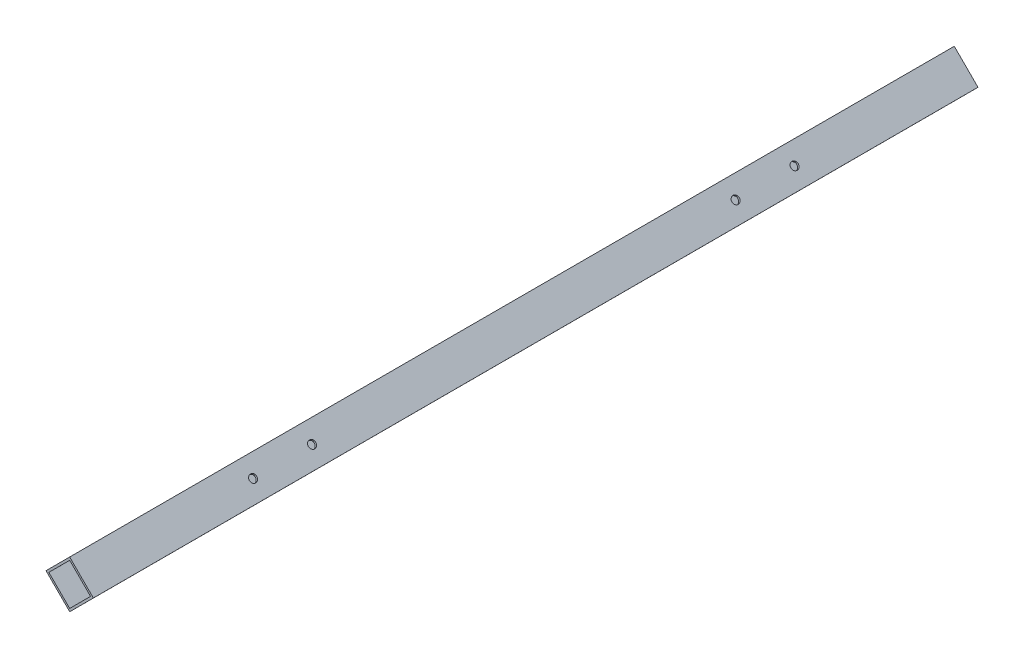
ISO-10303-21;
HEADER;
FILE_DESCRIPTION(('STEP AP214'),'2;1');
FILE_NAME('part.step','',(''),(''),'','','');
FILE_SCHEMA(('AUTOMOTIVE_DESIGN { 1 0 10303 214 1 1 1 1 }'));
ENDSEC;
DATA;
#1=APPLICATION_CONTEXT('core data for automotive mechanical design processes');
#2=APPLICATION_PROTOCOL_DEFINITION('international standard','automotive_design',2000,#1);
#3=PRODUCT_CONTEXT('',#1,'mechanical');
#4=PRODUCT('Part','Part','',(#3));
#5=PRODUCT_RELATED_PRODUCT_CATEGORY('part','',(#4));
#6=PRODUCT_DEFINITION_FORMATION('','',#4);
#7=PRODUCT_DEFINITION_CONTEXT('part definition',#1,'design');
#8=PRODUCT_DEFINITION('design','',#6,#7);
#9=PRODUCT_DEFINITION_SHAPE('','',#8);
#10=(LENGTH_UNIT() NAMED_UNIT(*) SI_UNIT(.MILLI.,.METRE.));
#11=(NAMED_UNIT(*) PLANE_ANGLE_UNIT() SI_UNIT($,.RADIAN.));
#12=(NAMED_UNIT(*) SI_UNIT($,.STERADIAN.) SOLID_ANGLE_UNIT());
#13=UNCERTAINTY_MEASURE_WITH_UNIT(LENGTH_MEASURE(1.E-05),#10,'distance_accuracy_value','');
#14=(GEOMETRIC_REPRESENTATION_CONTEXT(3) GLOBAL_UNCERTAINTY_ASSIGNED_CONTEXT((#13)) GLOBAL_UNIT_ASSIGNED_CONTEXT((#10,
#11,#12)) REPRESENTATION_CONTEXT('',''));
#15=CARTESIAN_POINT('',(0.,0.,0.));
#16=DIRECTION('',(0.,0.,1.));
#17=DIRECTION('',(1.,0.,0.));
#18=AXIS2_PLACEMENT_3D('',#15,#16,#17);
#19=CARTESIAN_POINT('',(0.,0.,660.));
#20=DIRECTION('',(0.,0.,1.));
#21=DIRECTION('',(1.,0.,0.));
#22=AXIS2_PLACEMENT_3D('',#19,#20,#21);
#23=PLANE('',#22);
#24=DIRECTION('',(-0.70646122875546,-0.707751744798503,0.));
#25=VECTOR('',#24,1.);
#26=CARTESIAN_POINT('',(0.,0.,660.));
#27=LINE('',#26,#25);
#28=CARTESIAN_POINT('',(0.,0.,660.));
#29=VERTEX_POINT('',#28);
#30=CARTESIAN_POINT('',(-17.6615307188865,-17.6937936199626,660.));
#31=VERTEX_POINT('',#30);
#32=EDGE_CURVE('E143',#29,#31,#27,.T.);
#33=ORIENTED_EDGE('',*,*,#32,.T.);
#34=DIRECTION('',(0.707751744798503,-0.70646122875546,0.));
#35=VECTOR('',#34,1.);
#36=CARTESIAN_POINT('',(-17.6615307188865,-17.6937936199626,660.));
#37=LINE('',#36,#35);
#38=CARTESIAN_POINT('',(0.0322629010760627,-35.3553243388491,660.));
#39=VERTEX_POINT('',#38);
#40=EDGE_CURVE('E146',#31,#39,#37,.T.);
#41=ORIENTED_EDGE('',*,*,#40,.T.);
#42=DIRECTION('',(0.70646122875546,0.707751744798503,0.));
#43=VECTOR('',#42,1.);
#44=CARTESIAN_POINT('',(17.6937936199626,-17.6615307188865,660.));
#45=LINE('',#44,#43);
#46=CARTESIAN_POINT('',(17.6937936199626,-17.6615307188865,660.));
#47=VERTEX_POINT('',#46);
#48=EDGE_CURVE('E149',#39,#47,#45,.T.);
#49=ORIENTED_EDGE('',*,*,#48,.T.);
#50=DIRECTION('',(-0.707751744798503,0.70646122875546,0.));
#51=VECTOR('',#50,1.);
#52=CARTESIAN_POINT('',(0.,0.,660.));
#53=LINE('',#52,#51);
#54=EDGE_CURVE('E151',#47,#29,#53,.T.);
#55=ORIENTED_EDGE('',*,*,#54,.T.);
#56=EDGE_LOOP('',(#33,#41,#49,#55));
#57=FACE_BOUND('',#56,.T.);
#58=DIRECTION('',(-0.706461228755461,-0.707751744798503,0.));
#59=VECTOR('',#58,1.);
#60=CARTESIAN_POINT('',(0.00193577406456353,-2.12131946033095,660.));
#61=LINE('',#60,#59);
#62=CARTESIAN_POINT('',(0.00193577406456353,-2.12131946033095,660.));
#63=VERTEX_POINT('',#62);
#64=CARTESIAN_POINT('',(-15.5402112585556,-17.691857845898,660.));
#65=VERTEX_POINT('',#64);
#66=EDGE_CURVE('E113',#63,#65,#61,.T.);
#67=ORIENTED_EDGE('',*,*,#66,.F.);
#68=DIRECTION('',(-0.707751744798503,0.70646122875546,0.));
#69=VECTOR('',#68,1.);
#70=CARTESIAN_POINT('',(0.00193577406456353,-2.12131946033095,660.));
#71=LINE('',#70,#69);
#72=CARTESIAN_POINT('',(15.5724741596316,-17.6634664929511,660.));
#73=VERTEX_POINT('',#72);
#74=EDGE_CURVE('E105',#73,#63,#71,.T.);
#75=ORIENTED_EDGE('',*,*,#74,.F.);
#76=DIRECTION('',(0.70646122875546,0.707751744798503,0.));
#77=VECTOR('',#76,1.);
#78=CARTESIAN_POINT('',(15.5724741596316,-17.6634664929511,660.));
#79=LINE('',#78,#77);
#80=CARTESIAN_POINT('',(0.0303271270114952,-33.2340048785181,660.));
#81=VERTEX_POINT('',#80);
#82=EDGE_CURVE('E127',#81,#73,#79,.T.);
#83=ORIENTED_EDGE('',*,*,#82,.F.);
#84=DIRECTION('',(0.707751744798503,-0.70646122875546,0.));
#85=VECTOR('',#84,1.);
#86=CARTESIAN_POINT('',(-15.5402112585556,-17.691857845898,660.));
#87=LINE('',#86,#85);
#88=EDGE_CURVE('E125',#65,#81,#87,.T.);
#89=ORIENTED_EDGE('',*,*,#88,.F.);
#90=EDGE_LOOP('',(#67,#75,#83,#89));
#91=FACE_BOUND('',#90,.T.);
#92=ADVANCED_FACE('F38',(#57,#91),#23,.T.);
#93=CARTESIAN_POINT('',(0.,0.,0.));
#94=DIRECTION('',(0.,0.,1.));
#95=DIRECTION('',(1.,0.,0.));
#96=AXIS2_PLACEMENT_3D('',#93,#94,#95);
#97=PLANE('',#96);
#98=DIRECTION('',(-0.70646122875546,-0.707751744798503,0.));
#99=VECTOR('',#98,1.);
#100=CARTESIAN_POINT('',(0.,0.,0.));
#101=LINE('',#100,#99);
#102=CARTESIAN_POINT('',(0.,0.,0.));
#103=VERTEX_POINT('',#102);
#104=CARTESIAN_POINT('',(-17.6615307188865,-17.6937936199626,0.));
#105=VERTEX_POINT('',#104);
#106=EDGE_CURVE('E121',#103,#105,#101,.T.);
#107=ORIENTED_EDGE('',*,*,#106,.F.);
#108=DIRECTION('',(-0.707751744798503,0.70646122875546,0.));
#109=VECTOR('',#108,1.);
#110=CARTESIAN_POINT('',(0.,0.,0.));
#111=LINE('',#110,#109);
#112=CARTESIAN_POINT('',(17.6937936199626,-17.6615307188865,0.));
#113=VERTEX_POINT('',#112);
#114=EDGE_CURVE('E147',#113,#103,#111,.T.);
#115=ORIENTED_EDGE('',*,*,#114,.F.);
#116=DIRECTION('',(0.70646122875546,0.707751744798503,0.));
#117=VECTOR('',#116,1.);
#118=CARTESIAN_POINT('',(17.6937936199626,-17.6615307188865,0.));
#119=LINE('',#118,#117);
#120=CARTESIAN_POINT('',(0.0322629010760627,-35.3553243388491,0.));
#121=VERTEX_POINT('',#120);
#122=EDGE_CURVE('E158',#121,#113,#119,.T.);
#123=ORIENTED_EDGE('',*,*,#122,.F.);
#124=DIRECTION('',(0.707751744798503,-0.70646122875546,0.));
#125=VECTOR('',#124,1.);
#126=CARTESIAN_POINT('',(-17.6615307188865,-17.6937936199626,0.));
#127=LINE('',#126,#125);
#128=EDGE_CURVE('E156',#105,#121,#127,.T.);
#129=ORIENTED_EDGE('',*,*,#128,.F.);
#130=EDGE_LOOP('',(#107,#115,#123,#129));
#131=FACE_BOUND('',#130,.T.);
#132=DIRECTION('',(-0.707751744798503,0.70646122875546,0.));
#133=VECTOR('',#132,1.);
#134=CARTESIAN_POINT('',(0.00193577406456353,-2.12131946033095,0.));
#135=LINE('',#134,#133);
#136=CARTESIAN_POINT('',(15.5724741596316,-17.6634664929511,0.));
#137=VERTEX_POINT('',#136);
#138=CARTESIAN_POINT('',(0.00193577406456353,-2.12131946033095,0.));
#139=VERTEX_POINT('',#138);
#140=EDGE_CURVE('E63',#137,#139,#135,.T.);
#141=ORIENTED_EDGE('',*,*,#140,.T.);
#142=DIRECTION('',(-0.706461228755461,-0.707751744798503,0.));
#143=VECTOR('',#142,1.);
#144=CARTESIAN_POINT('',(0.00193577406456353,-2.12131946033095,0.));
#145=LINE('',#144,#143);
#146=CARTESIAN_POINT('',(-15.5402112585556,-17.691857845898,0.));
#147=VERTEX_POINT('',#146);
#148=EDGE_CURVE('E120',#139,#147,#145,.T.);
#149=ORIENTED_EDGE('',*,*,#148,.T.);
#150=DIRECTION('',(0.707751744798503,-0.70646122875546,0.));
#151=VECTOR('',#150,1.);
#152=CARTESIAN_POINT('',(-15.5402112585556,-17.691857845898,0.));
#153=LINE('',#152,#151);
#154=CARTESIAN_POINT('',(0.0303271270114987,-33.2340048785181,0.));
#155=VERTEX_POINT('',#154);
#156=EDGE_CURVE('E135',#147,#155,#153,.T.);
#157=ORIENTED_EDGE('',*,*,#156,.T.);
#158=DIRECTION('',(0.70646122875546,0.707751744798503,0.));
#159=VECTOR('',#158,1.);
#160=CARTESIAN_POINT('',(15.5724741596316,-17.6634664929511,0.));
#161=LINE('',#160,#159);
#162=EDGE_CURVE('E114',#155,#137,#161,.T.);
#163=ORIENTED_EDGE('',*,*,#162,.T.);
#164=EDGE_LOOP('',(#141,#149,#157,#163));
#165=FACE_BOUND('',#164,.T.);
#166=ADVANCED_FACE('F227',(#131,#165),#97,.F.);
#167=CARTESIAN_POINT('',(0.,0.,660.));
#168=DIRECTION('',(0.707751744798503,-0.70646122875546,0.));
#169=DIRECTION('',(0.70646122875546,0.707751744798503,0.));
#170=AXIS2_PLACEMENT_3D('',#167,#168,#169);
#171=PLANE('',#170);
#172=ORIENTED_EDGE('',*,*,#106,.T.);
#173=DIRECTION('',(0.,0.,-1.));
#174=VECTOR('',#173,1.);
#175=CARTESIAN_POINT('',(-17.6615307188865,-17.6937936199626,660.));
#176=LINE('',#175,#174);
#177=EDGE_CURVE('E11',#31,#105,#176,.T.);
#178=ORIENTED_EDGE('',*,*,#177,.F.);
#179=ORIENTED_EDGE('',*,*,#32,.F.);
#180=DIRECTION('',(0.,0.,-1.));
#181=VECTOR('',#180,1.);
#182=CARTESIAN_POINT('',(0.,0.,660.));
#183=LINE('',#182,#181);
#184=EDGE_CURVE('E153',#29,#103,#183,.T.);
#185=ORIENTED_EDGE('',*,*,#184,.T.);
#186=EDGE_LOOP('',(#172,#178,#179,#185));
#187=FACE_BOUND('',#186,.T.);
#188=ADVANCED_FACE('F40',(#187),#171,.F.);
#189=CARTESIAN_POINT('',(-17.6615307188865,-17.6937936199626,660.));
#190=DIRECTION('',(0.70646122875546,0.707751744798503,0.));
#191=DIRECTION('',(-0.707751744798503,0.70646122875546,0.));
#192=AXIS2_PLACEMENT_3D('',#189,#190,#191);
#193=PLANE('',#192);
#194=CARTESIAN_POINT('',(-8.81463390890522,-26.5245589794058,532.));
#195=DIRECTION('',(0.70646122875546,0.707751744798503,0.));
#196=DIRECTION('',(-0.707751744798503,0.70646122875546,0.));
#197=AXIS2_PLACEMENT_3D('',#194,#195,#196);
#198=CIRCLE('',#197,2.74999999999996);
#199=CARTESIAN_POINT('',(-10.7609512071011,-24.5817906003283,532.));
#200=VERTEX_POINT('',#199);
#201=EDGE_CURVE('E133',#200,#200,#198,.T.);
#202=ORIENTED_EDGE('',*,*,#201,.T.);
#203=EDGE_LOOP('',(#202));
#204=FACE_BOUND('',#203,.T.);
#205=CARTESIAN_POINT('',(-8.81463390890523,-26.5245589794058,128.));
#206=DIRECTION('',(0.70646122875546,0.707751744798503,0.));
#207=DIRECTION('',(-0.707751744798503,0.70646122875546,0.));
#208=AXIS2_PLACEMENT_3D('',#205,#206,#207);
#209=CIRCLE('',#208,2.75);
#210=CARTESIAN_POINT('',(-10.7609512071011,-24.5817906003283,128.));
#211=VERTEX_POINT('',#210);
#212=EDGE_CURVE('E184',#211,#211,#209,.T.);
#213=ORIENTED_EDGE('',*,*,#212,.T.);
#214=EDGE_LOOP('',(#213));
#215=FACE_BOUND('',#214,.T.);
#216=CARTESIAN_POINT('',(-8.81463390890523,-26.5245589794058,172.));
#217=DIRECTION('',(0.70646122875546,0.707751744798503,0.));
#218=DIRECTION('',(-0.707751744798503,0.70646122875546,0.));
#219=AXIS2_PLACEMENT_3D('',#216,#217,#218);
#220=CIRCLE('',#219,2.75);
#221=CARTESIAN_POINT('',(-10.7609512071011,-24.5817906003283,172.));
#222=VERTEX_POINT('',#221);
#223=EDGE_CURVE('E180',#222,#222,#220,.T.);
#224=ORIENTED_EDGE('',*,*,#223,.T.);
#225=EDGE_LOOP('',(#224));
#226=FACE_BOUND('',#225,.T.);
#227=CARTESIAN_POINT('',(-8.81463390890523,-26.5245589794058,488.));
#228=DIRECTION('',(0.70646122875546,0.707751744798503,0.));
#229=DIRECTION('',(-0.707751744798503,0.70646122875546,0.));
#230=AXIS2_PLACEMENT_3D('',#227,#228,#229);
#231=CIRCLE('',#230,2.75);
#232=CARTESIAN_POINT('',(-10.7609512071011,-24.5817906003283,488.));
#233=VERTEX_POINT('',#232);
#234=EDGE_CURVE('E176',#233,#233,#231,.T.);
#235=ORIENTED_EDGE('',*,*,#234,.T.);
#236=EDGE_LOOP('',(#235));
#237=FACE_BOUND('',#236,.T.);
#238=ORIENTED_EDGE('',*,*,#128,.T.);
#239=DIRECTION('',(0.,0.,-1.));
#240=VECTOR('',#239,1.);
#241=CARTESIAN_POINT('',(0.0322629010760627,-35.3553243388491,660.));
#242=LINE('',#241,#240);
#243=EDGE_CURVE('E47',#39,#121,#242,.T.);
#244=ORIENTED_EDGE('',*,*,#243,.F.);
#245=ORIENTED_EDGE('',*,*,#40,.F.);
#246=ORIENTED_EDGE('',*,*,#177,.T.);
#247=EDGE_LOOP('',(#238,#244,#245,#246));
#248=FACE_BOUND('',#247,.T.);
#249=ADVANCED_FACE('F201',(#204,#215,#226,#237,#248),#193,.F.);
#250=CARTESIAN_POINT('',(17.6937936199626,-17.6615307188865,660.));
#251=DIRECTION('',(-0.707751744798503,0.70646122875546,0.));
#252=DIRECTION('',(-0.70646122875546,-0.707751744798503,0.));
#253=AXIS2_PLACEMENT_3D('',#250,#251,#252);
#254=PLANE('',#253);
#255=ORIENTED_EDGE('',*,*,#122,.T.);
#256=DIRECTION('',(0.,0.,-1.));
#257=VECTOR('',#256,1.);
#258=CARTESIAN_POINT('',(17.6937936199626,-17.6615307188865,660.));
#259=LINE('',#258,#257);
#260=EDGE_CURVE('E163',#47,#113,#259,.T.);
#261=ORIENTED_EDGE('',*,*,#260,.F.);
#262=ORIENTED_EDGE('',*,*,#48,.F.);
#263=ORIENTED_EDGE('',*,*,#243,.T.);
#264=EDGE_LOOP('',(#255,#261,#262,#263));
#265=FACE_BOUND('',#264,.T.);
#266=ADVANCED_FACE('F241',(#265),#254,.F.);
#267=CARTESIAN_POINT('',(0.,0.,660.));
#268=DIRECTION('',(-0.70646122875546,-0.707751744798503,0.));
#269=DIRECTION('',(0.707751744798503,-0.70646122875546,0.));
#270=AXIS2_PLACEMENT_3D('',#267,#268,#269);
#271=PLANE('',#270);
#272=CARTESIAN_POINT('',(8.84689680998128,-8.83076535944326,532.));
#273=DIRECTION('',(0.706461228755461,0.707751744798503,0.));
#274=DIRECTION('',(-0.707751744798503,0.706461228755461,0.));
#275=AXIS2_PLACEMENT_3D('',#272,#273,#274);
#276=CIRCLE('',#275,2.74999999999996);
#277=CARTESIAN_POINT('',(6.90057951178543,-6.88799698036577,532.));
#278=VERTEX_POINT('',#277);
#279=EDGE_CURVE('E297',#278,#278,#276,.T.);
#280=ORIENTED_EDGE('',*,*,#279,.F.);
#281=EDGE_LOOP('',(#280));
#282=FACE_BOUND('',#281,.T.);
#283=CARTESIAN_POINT('',(8.84689680998128,-8.83076535944326,128.));
#284=DIRECTION('',(0.706461228755461,0.707751744798503,0.));
#285=DIRECTION('',(-0.707751744798503,0.706461228755461,0.));
#286=AXIS2_PLACEMENT_3D('',#283,#284,#285);
#287=CIRCLE('',#286,2.75);
#288=CARTESIAN_POINT('',(6.9005795117854,-6.88799698036574,128.));
#289=VERTEX_POINT('',#288);
#290=EDGE_CURVE('E298',#289,#289,#287,.T.);
#291=ORIENTED_EDGE('',*,*,#290,.F.);
#292=EDGE_LOOP('',(#291));
#293=FACE_BOUND('',#292,.T.);
#294=CARTESIAN_POINT('',(8.84689680998128,-8.83076535944326,172.));
#295=DIRECTION('',(0.706461228755461,0.707751744798503,0.));
#296=DIRECTION('',(-0.707751744798503,0.706461228755461,0.));
#297=AXIS2_PLACEMENT_3D('',#294,#295,#296);
#298=CIRCLE('',#297,2.75);
#299=CARTESIAN_POINT('',(6.9005795117854,-6.88799698036574,172.));
#300=VERTEX_POINT('',#299);
#301=EDGE_CURVE('E301',#300,#300,#298,.T.);
#302=ORIENTED_EDGE('',*,*,#301,.F.);
#303=EDGE_LOOP('',(#302));
#304=FACE_BOUND('',#303,.T.);
#305=CARTESIAN_POINT('',(8.84689680998128,-8.83076535944326,488.));
#306=DIRECTION('',(0.706461228755461,0.707751744798503,0.));
#307=DIRECTION('',(-0.707751744798503,0.706461228755461,0.));
#308=AXIS2_PLACEMENT_3D('',#305,#306,#307);
#309=CIRCLE('',#308,2.75);
#310=CARTESIAN_POINT('',(6.9005795117854,-6.88799698036574,488.));
#311=VERTEX_POINT('',#310);
#312=EDGE_CURVE('E172',#311,#311,#309,.T.);
#313=ORIENTED_EDGE('',*,*,#312,.F.);
#314=EDGE_LOOP('',(#313));
#315=FACE_BOUND('',#314,.T.);
#316=ORIENTED_EDGE('',*,*,#114,.T.);
#317=ORIENTED_EDGE('',*,*,#184,.F.);
#318=ORIENTED_EDGE('',*,*,#54,.F.);
#319=ORIENTED_EDGE('',*,*,#260,.T.);
#320=EDGE_LOOP('',(#316,#317,#318,#319));
#321=FACE_BOUND('',#320,.T.);
#322=ADVANCED_FACE('F238',(#282,#293,#304,#315,#321),#271,.F.);
#323=CARTESIAN_POINT('',(0.00193577406456353,-2.12131946033095,660.));
#324=DIRECTION('',(-0.70646122875546,-0.707751744798503,0.));
#325=DIRECTION('',(0.707751744798503,-0.70646122875546,0.));
#326=AXIS2_PLACEMENT_3D('',#323,#324,#325);
#327=PLANE('',#326);
#328=CARTESIAN_POINT('',(7.7872049668481,-9.89239297664101,532.));
#329=DIRECTION('',(-0.70646122875546,-0.707751744798503,0.));
#330=DIRECTION('',(0.707751744798503,-0.70646122875546,0.));
#331=AXIS2_PLACEMENT_3D('',#328,#329,#330);
#332=CIRCLE('',#331,2.74999999999996);
#333=CARTESIAN_POINT('',(9.73352226504395,-11.8351613557185,532.));
#334=VERTEX_POINT('',#333);
#335=EDGE_CURVE('E196',#334,#334,#332,.T.);
#336=ORIENTED_EDGE('',*,*,#335,.F.);
#337=EDGE_LOOP('',(#336));
#338=FACE_BOUND('',#337,.T.);
#339=CARTESIAN_POINT('',(7.7872049668481,-9.892392976641,128.));
#340=DIRECTION('',(-0.70646122875546,-0.707751744798503,0.));
#341=DIRECTION('',(0.707751744798503,-0.70646122875546,0.));
#342=AXIS2_PLACEMENT_3D('',#339,#340,#341);
#343=CIRCLE('',#342,2.75);
#344=CARTESIAN_POINT('',(9.73352226504398,-11.8351613557185,128.));
#345=VERTEX_POINT('',#344);
#346=EDGE_CURVE('E179',#345,#345,#343,.T.);
#347=ORIENTED_EDGE('',*,*,#346,.F.);
#348=EDGE_LOOP('',(#347));
#349=FACE_BOUND('',#348,.T.);
#350=CARTESIAN_POINT('',(7.7872049668481,-9.892392976641,172.));
#351=DIRECTION('',(-0.70646122875546,-0.707751744798503,0.));
#352=DIRECTION('',(0.707751744798503,-0.70646122875546,0.));
#353=AXIS2_PLACEMENT_3D('',#350,#351,#352);
#354=CIRCLE('',#353,2.75);
#355=CARTESIAN_POINT('',(9.73352226504398,-11.8351613557185,172.));
#356=VERTEX_POINT('',#355);
#357=EDGE_CURVE('E175',#356,#356,#354,.T.);
#358=ORIENTED_EDGE('',*,*,#357,.F.);
#359=EDGE_LOOP('',(#358));
#360=FACE_BOUND('',#359,.T.);
#361=CARTESIAN_POINT('',(7.7872049668481,-9.892392976641,488.));
#362=DIRECTION('',(-0.70646122875546,-0.707751744798503,0.));
#363=DIRECTION('',(0.707751744798503,-0.70646122875546,0.));
#364=AXIS2_PLACEMENT_3D('',#361,#362,#363);
#365=CIRCLE('',#364,2.75);
#366=CARTESIAN_POINT('',(9.73352226504398,-11.8351613557185,488.));
#367=VERTEX_POINT('',#366);
#368=EDGE_CURVE('E171',#367,#367,#365,.T.);
#369=ORIENTED_EDGE('',*,*,#368,.F.);
#370=EDGE_LOOP('',(#369));
#371=FACE_BOUND('',#370,.T.);
#372=ORIENTED_EDGE('',*,*,#140,.F.);
#373=DIRECTION('',(0.,0.,-1.));
#374=VECTOR('',#373,1.);
#375=CARTESIAN_POINT('',(15.5724741596316,-17.6634664929511,660.));
#376=LINE('',#375,#374);
#377=EDGE_CURVE('E109',#73,#137,#376,.T.);
#378=ORIENTED_EDGE('',*,*,#377,.F.);
#379=ORIENTED_EDGE('',*,*,#74,.T.);
#380=DIRECTION('',(0.,0.,-1.));
#381=VECTOR('',#380,1.);
#382=CARTESIAN_POINT('',(0.00193577406456353,-2.12131946033095,660.));
#383=LINE('',#382,#381);
#384=EDGE_CURVE('E108',#63,#139,#383,.T.);
#385=ORIENTED_EDGE('',*,*,#384,.T.);
#386=EDGE_LOOP('',(#372,#378,#379,#385));
#387=FACE_BOUND('',#386,.T.);
#388=ADVANCED_FACE('F107',(#338,#349,#360,#371,#387),#327,.T.);
#389=CARTESIAN_POINT('',(0.00193577406456353,-2.12131946033095,660.));
#390=DIRECTION('',(0.707751744798503,-0.706461228755461,0.));
#391=DIRECTION('',(0.706461228755461,0.707751744798503,0.));
#392=AXIS2_PLACEMENT_3D('',#389,#390,#391);
#393=PLANE('',#392);
#394=ORIENTED_EDGE('',*,*,#148,.F.);
#395=ORIENTED_EDGE('',*,*,#384,.F.);
#396=ORIENTED_EDGE('',*,*,#66,.T.);
#397=DIRECTION('',(0.,0.,-1.));
#398=VECTOR('',#397,1.);
#399=CARTESIAN_POINT('',(-15.5402112585556,-17.691857845898,660.));
#400=LINE('',#399,#398);
#401=EDGE_CURVE('E122',#65,#147,#400,.T.);
#402=ORIENTED_EDGE('',*,*,#401,.T.);
#403=EDGE_LOOP('',(#394,#395,#396,#402));
#404=FACE_BOUND('',#403,.T.);
#405=ADVANCED_FACE('F117',(#404),#393,.T.);
#406=CARTESIAN_POINT('',(-15.5402112585556,-17.691857845898,660.));
#407=DIRECTION('',(0.70646122875546,0.707751744798503,0.));
#408=DIRECTION('',(-0.707751744798503,0.70646122875546,0.));
#409=AXIS2_PLACEMENT_3D('',#406,#407,#408);
#410=PLANE('',#409);
#411=CARTESIAN_POINT('',(-7.75494206577203,-25.4629313622081,532.));
#412=DIRECTION('',(0.70646122875546,0.707751744798503,0.));
#413=DIRECTION('',(-0.707751744798503,0.70646122875546,0.));
#414=AXIS2_PLACEMENT_3D('',#411,#412,#413);
#415=CIRCLE('',#414,2.74999999999996);
#416=CARTESIAN_POINT('',(-9.70125936396789,-23.5201629831306,532.));
#417=VERTEX_POINT('',#416);
#418=EDGE_CURVE('E42',#417,#417,#415,.T.);
#419=ORIENTED_EDGE('',*,*,#418,.F.);
#420=EDGE_LOOP('',(#419));
#421=FACE_BOUND('',#420,.T.);
#422=CARTESIAN_POINT('',(-7.75494206577204,-25.4629313622081,128.));
#423=DIRECTION('',(0.70646122875546,0.707751744798503,0.));
#424=DIRECTION('',(-0.707751744798503,0.70646122875546,0.));
#425=AXIS2_PLACEMENT_3D('',#422,#423,#424);
#426=CIRCLE('',#425,2.75);
#427=CARTESIAN_POINT('',(-9.70125936396792,-23.5201629831306,128.));
#428=VERTEX_POINT('',#427);
#429=EDGE_CURVE('E177',#428,#428,#426,.T.);
#430=ORIENTED_EDGE('',*,*,#429,.F.);
#431=EDGE_LOOP('',(#430));
#432=FACE_BOUND('',#431,.T.);
#433=CARTESIAN_POINT('',(-7.75494206577204,-25.4629313622081,172.));
#434=DIRECTION('',(0.70646122875546,0.707751744798503,0.));
#435=DIRECTION('',(-0.707751744798503,0.70646122875546,0.));
#436=AXIS2_PLACEMENT_3D('',#433,#434,#435);
#437=CIRCLE('',#436,2.75);
#438=CARTESIAN_POINT('',(-9.70125936396792,-23.5201629831306,172.));
#439=VERTEX_POINT('',#438);
#440=EDGE_CURVE('E173',#439,#439,#437,.T.);
#441=ORIENTED_EDGE('',*,*,#440,.F.);
#442=EDGE_LOOP('',(#441));
#443=FACE_BOUND('',#442,.T.);
#444=CARTESIAN_POINT('',(-7.75494206577204,-25.4629313622081,488.));
#445=DIRECTION('',(0.70646122875546,0.707751744798503,0.));
#446=DIRECTION('',(-0.707751744798503,0.70646122875546,0.));
#447=AXIS2_PLACEMENT_3D('',#444,#445,#446);
#448=CIRCLE('',#447,2.75);
#449=CARTESIAN_POINT('',(-9.70125936396792,-23.5201629831306,488.));
#450=VERTEX_POINT('',#449);
#451=EDGE_CURVE('E168',#450,#450,#448,.T.);
#452=ORIENTED_EDGE('',*,*,#451,.F.);
#453=EDGE_LOOP('',(#452));
#454=FACE_BOUND('',#453,.T.);
#455=ORIENTED_EDGE('',*,*,#156,.F.);
#456=ORIENTED_EDGE('',*,*,#401,.F.);
#457=ORIENTED_EDGE('',*,*,#88,.T.);
#458=DIRECTION('',(0.,0.,-1.));
#459=VECTOR('',#458,1.);
#460=CARTESIAN_POINT('',(0.0303271270114987,-33.2340048785181,660.));
#461=LINE('',#460,#459);
#462=EDGE_CURVE('E55',#81,#155,#461,.T.);
#463=ORIENTED_EDGE('',*,*,#462,.T.);
#464=EDGE_LOOP('',(#455,#456,#457,#463));
#465=FACE_BOUND('',#464,.T.);
#466=ADVANCED_FACE('F268',(#421,#432,#443,#454,#465),#410,.T.);
#467=CARTESIAN_POINT('',(15.5724741596316,-17.6634664929511,660.));
#468=DIRECTION('',(-0.707751744798503,0.70646122875546,0.));
#469=DIRECTION('',(-0.70646122875546,-0.707751744798503,0.));
#470=AXIS2_PLACEMENT_3D('',#467,#468,#469);
#471=PLANE('',#470);
#472=ORIENTED_EDGE('',*,*,#162,.F.);
#473=ORIENTED_EDGE('',*,*,#462,.F.);
#474=ORIENTED_EDGE('',*,*,#82,.T.);
#475=ORIENTED_EDGE('',*,*,#377,.T.);
#476=EDGE_LOOP('',(#472,#473,#474,#475));
#477=FACE_BOUND('',#476,.T.);
#478=ADVANCED_FACE('F266',(#477),#471,.T.);
#479=CARTESIAN_POINT('',(-17.6453845613123,-35.3714410554851,488.));
#480=DIRECTION('',(0.70646122875546,0.707751744798503,0.));
#481=DIRECTION('',(-0.707751744798503,0.706461228755461,0.));
#482=AXIS2_PLACEMENT_3D('',#479,#480,#481);
#483=CYLINDRICAL_SURFACE('',#482,2.75);
#484=ORIENTED_EDGE('',*,*,#451,.T.);
#485=EDGE_LOOP('',(#484));
#486=FACE_BOUND('',#485,.T.);
#487=ORIENTED_EDGE('',*,*,#234,.F.);
#488=EDGE_LOOP('',(#487));
#489=FACE_BOUND('',#488,.T.);
#490=ADVANCED_FACE('F218',(#486,#489),#483,.F.);
#491=CARTESIAN_POINT('',(-17.6453845613123,-35.3714410554851,172.));
#492=DIRECTION('',(0.70646122875546,0.707751744798503,0.));
#493=DIRECTION('',(-0.707751744798503,0.706461228755461,0.));
#494=AXIS2_PLACEMENT_3D('',#491,#492,#493);
#495=CYLINDRICAL_SURFACE('',#494,2.75);
#496=ORIENTED_EDGE('',*,*,#440,.T.);
#497=EDGE_LOOP('',(#496));
#498=FACE_BOUND('',#497,.T.);
#499=ORIENTED_EDGE('',*,*,#223,.F.);
#500=EDGE_LOOP('',(#499));
#501=FACE_BOUND('',#500,.T.);
#502=ADVANCED_FACE('F219',(#498,#501),#495,.F.);
#503=CARTESIAN_POINT('',(-17.6453845613123,-35.3714410554851,128.));
#504=DIRECTION('',(0.70646122875546,0.707751744798503,0.));
#505=DIRECTION('',(-0.707751744798503,0.706461228755461,0.));
#506=AXIS2_PLACEMENT_3D('',#503,#504,#505);
#507=CYLINDRICAL_SURFACE('',#506,2.75);
#508=ORIENTED_EDGE('',*,*,#429,.T.);
#509=EDGE_LOOP('',(#508));
#510=FACE_BOUND('',#509,.T.);
#511=ORIENTED_EDGE('',*,*,#212,.F.);
#512=EDGE_LOOP('',(#511));
#513=FACE_BOUND('',#512,.T.);
#514=ADVANCED_FACE('F207',(#510,#513),#507,.F.);
#515=CARTESIAN_POINT('',(-17.6453845613123,-35.3714410554851,532.));
#516=DIRECTION('',(0.70646122875546,0.707751744798503,0.));
#517=DIRECTION('',(-0.707751744798503,0.706461228755461,0.));
#518=AXIS2_PLACEMENT_3D('',#515,#516,#517);
#519=CYLINDRICAL_SURFACE('',#518,2.74999999999996);
#520=ORIENTED_EDGE('',*,*,#418,.T.);
#521=EDGE_LOOP('',(#520));
#522=FACE_BOUND('',#521,.T.);
#523=ORIENTED_EDGE('',*,*,#201,.F.);
#524=EDGE_LOOP('',(#523));
#525=FACE_BOUND('',#524,.T.);
#526=ADVANCED_FACE('F204',(#522,#525),#519,.F.);
#527=ORIENTED_EDGE('',*,*,#368,.T.);
#528=EDGE_LOOP('',(#527));
#529=FACE_BOUND('',#528,.T.);
#530=ORIENTED_EDGE('',*,*,#312,.T.);
#531=EDGE_LOOP('',(#530));
#532=FACE_BOUND('',#531,.T.);
#533=ADVANCED_FACE('F206',(#529,#532),#483,.F.);
#534=ORIENTED_EDGE('',*,*,#357,.T.);
#535=EDGE_LOOP('',(#534));
#536=FACE_BOUND('',#535,.T.);
#537=ORIENTED_EDGE('',*,*,#301,.T.);
#538=EDGE_LOOP('',(#537));
#539=FACE_BOUND('',#538,.T.);
#540=ADVANCED_FACE('F215',(#536,#539),#495,.F.);
#541=ORIENTED_EDGE('',*,*,#346,.T.);
#542=EDGE_LOOP('',(#541));
#543=FACE_BOUND('',#542,.T.);
#544=ORIENTED_EDGE('',*,*,#290,.T.);
#545=EDGE_LOOP('',(#544));
#546=FACE_BOUND('',#545,.T.);
#547=ADVANCED_FACE('F221',(#543,#546),#507,.F.);
#548=ORIENTED_EDGE('',*,*,#335,.T.);
#549=EDGE_LOOP('',(#548));
#550=FACE_BOUND('',#549,.T.);
#551=ORIENTED_EDGE('',*,*,#279,.T.);
#552=EDGE_LOOP('',(#551));
#553=FACE_BOUND('',#552,.T.);
#554=ADVANCED_FACE('F210',(#550,#553),#519,.F.);
#555=CLOSED_SHELL('',(#92,#166,#188,#249,#266,#322,#388,#405,#466,#478,#490,#502,#514,#526,#533,
#540,#547,#554));
#556=MANIFOLD_SOLID_BREP('B2',#555);
#557=ADVANCED_BREP_SHAPE_REPRESENTATION('',(#18,#556),#14);
#558=SHAPE_DEFINITION_REPRESENTATION(#9,#557);
ENDSEC;
END-ISO-10303-21;
